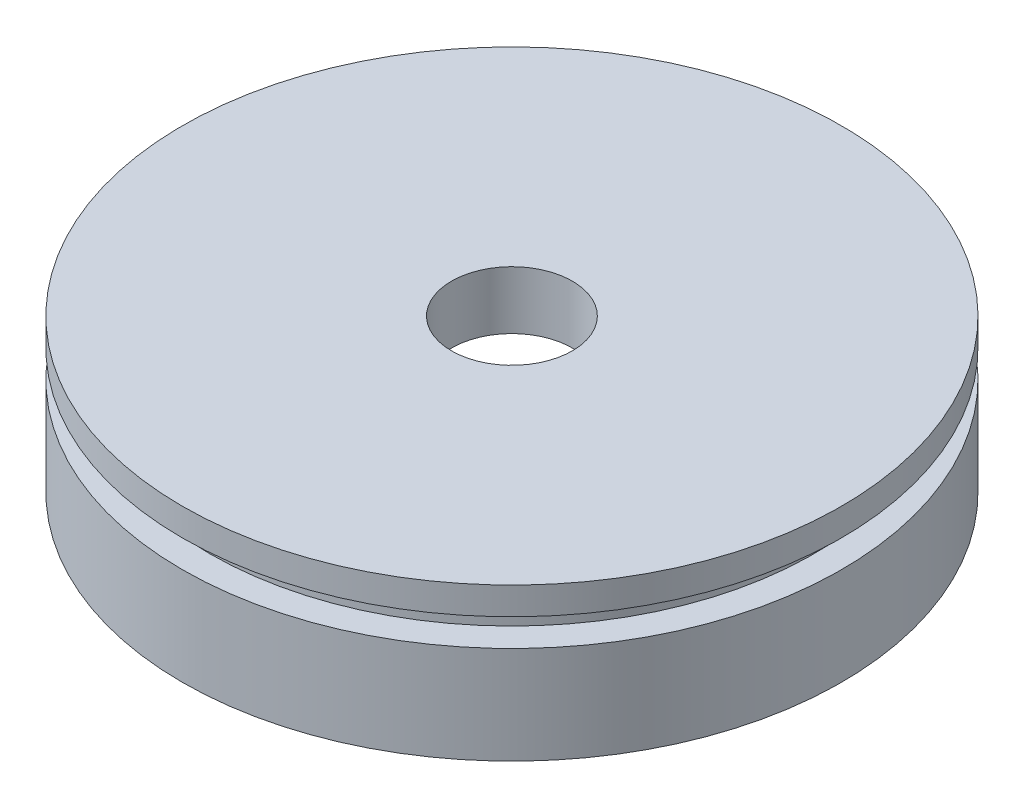
ISO-10303-21;
HEADER;
FILE_DESCRIPTION(('STEP AP214'),'2;1');
FILE_NAME('part.step','',(''),(''),'','','');
FILE_SCHEMA(('AUTOMOTIVE_DESIGN { 1 0 10303 214 1 1 1 1 }'));
ENDSEC;
DATA;
#1=APPLICATION_CONTEXT('core data for automotive mechanical design processes');
#2=APPLICATION_PROTOCOL_DEFINITION('international standard','automotive_design',2000,#1);
#3=PRODUCT_CONTEXT('',#1,'mechanical');
#4=PRODUCT('Part','Part','',(#3));
#5=PRODUCT_RELATED_PRODUCT_CATEGORY('part','',(#4));
#6=PRODUCT_DEFINITION_FORMATION('','',#4);
#7=PRODUCT_DEFINITION_CONTEXT('part definition',#1,'design');
#8=PRODUCT_DEFINITION('design','',#6,#7);
#9=PRODUCT_DEFINITION_SHAPE('','',#8);
#10=(LENGTH_UNIT() NAMED_UNIT(*) SI_UNIT(.MILLI.,.METRE.));
#11=(NAMED_UNIT(*) PLANE_ANGLE_UNIT() SI_UNIT($,.RADIAN.));
#12=(NAMED_UNIT(*) SI_UNIT($,.STERADIAN.) SOLID_ANGLE_UNIT());
#13=UNCERTAINTY_MEASURE_WITH_UNIT(LENGTH_MEASURE(1.E-05),#10,'distance_accuracy_value','');
#14=(GEOMETRIC_REPRESENTATION_CONTEXT(3) GLOBAL_UNCERTAINTY_ASSIGNED_CONTEXT((#13)) GLOBAL_UNIT_ASSIGNED_CONTEXT((#10,
#11,#12)) REPRESENTATION_CONTEXT('',''));
#15=CARTESIAN_POINT('',(0.,0.,0.));
#16=DIRECTION('',(0.,0.,1.));
#17=DIRECTION('',(1.,0.,0.));
#18=AXIS2_PLACEMENT_3D('',#15,#16,#17);
#19=CARTESIAN_POINT('',(0.,50.3580155806544,0.));
#20=DIRECTION('',(0.,1.,0.));
#21=DIRECTION('',(0.,0.,1.));
#22=AXIS2_PLACEMENT_3D('',#19,#20,#21);
#23=CYLINDRICAL_SURFACE('',#22,13.9700000000002);
#24=CARTESIAN_POINT('',(0.,1882.394,0.));
#25=DIRECTION('',(0.,1.,0.));
#26=DIRECTION('',(0.,0.,1.));
#27=AXIS2_PLACEMENT_3D('',#24,#25,#26);
#28=CIRCLE('',#27,13.9700000000002);
#29=CARTESIAN_POINT('',(0.,1882.394,13.9700000000002));
#30=VERTEX_POINT('',#29);
#31=EDGE_CURVE('E74',#30,#30,#28,.T.);
#32=ORIENTED_EDGE('',*,*,#31,.T.);
#33=EDGE_LOOP('',(#32));
#34=FACE_BOUND('',#33,.T.);
#35=CARTESIAN_POINT('',(0.,1868.995022229,0.));
#36=DIRECTION('',(0.,1.,0.));
#37=DIRECTION('',(0.,0.,1.));
#38=AXIS2_PLACEMENT_3D('',#35,#36,#37);
#39=CIRCLE('',#38,13.9700000000002);
#40=CARTESIAN_POINT('',(0.,1868.995022229,13.9700000000002));
#41=VERTEX_POINT('',#40);
#42=EDGE_CURVE('E10',#41,#41,#39,.T.);
#43=ORIENTED_EDGE('',*,*,#42,.F.);
#44=EDGE_LOOP('',(#43));
#45=FACE_BOUND('',#44,.T.);
#46=ADVANCED_FACE('F39',(#34,#45),#23,.F.);
#47=CARTESIAN_POINT('',(-2.08166817117217E-13,1729.74,0.));
#48=DIRECTION('',(0.,1.,0.));
#49=DIRECTION('',(-1.,0.,0.));
#50=AXIS2_PLACEMENT_3D('',#47,#48,#49);
#51=SPHERICAL_SURFACE('',#50,139.954);
#52=ORIENTED_EDGE('',*,*,#42,.T.);
#53=EDGE_LOOP('',(#52));
#54=FACE_BOUND('',#53,.T.);
#55=CARTESIAN_POINT('',(0.,1847.13115007529,0.));
#56=DIRECTION('',(0.,1.,0.));
#57=DIRECTION('',(0.,0.,1.));
#58=AXIS2_PLACEMENT_3D('',#55,#56,#57);
#59=CIRCLE('',#58,76.2000000000002);
#60=CARTESIAN_POINT('',(0.,1847.13115007529,76.2000000000002));
#61=VERTEX_POINT('',#60);
#62=EDGE_CURVE('E46',#61,#61,#59,.T.);
#63=ORIENTED_EDGE('',*,*,#62,.F.);
#64=EDGE_LOOP('',(#63));
#65=FACE_BOUND('',#64,.T.);
#66=ADVANCED_FACE('F93',(#54,#65),#51,.F.);
#67=CARTESIAN_POINT('',(0.,50.3580155806544,0.));
#68=DIRECTION('',(0.,1.,0.));
#69=DIRECTION('',(0.,0.,1.));
#70=AXIS2_PLACEMENT_3D('',#67,#68,#69);
#71=CYLINDRICAL_SURFACE('',#70,76.2000000000002);
#72=ORIENTED_EDGE('',*,*,#62,.T.);
#73=EDGE_LOOP('',(#72));
#74=FACE_BOUND('',#73,.T.);
#75=CARTESIAN_POINT('',(0.,1869.694,0.));
#76=DIRECTION('',(0.,1.,0.));
#77=DIRECTION('',(0.,0.,1.));
#78=AXIS2_PLACEMENT_3D('',#75,#76,#77);
#79=CIRCLE('',#78,76.2000000000002);
#80=CARTESIAN_POINT('',(0.,1869.694,76.2000000000002));
#81=VERTEX_POINT('',#80);
#82=EDGE_CURVE('E51',#81,#81,#79,.T.);
#83=ORIENTED_EDGE('',*,*,#82,.F.);
#84=EDGE_LOOP('',(#83));
#85=FACE_BOUND('',#84,.T.);
#86=ADVANCED_FACE('F97',(#74,#85),#71,.T.);
#87=CARTESIAN_POINT('',(-69.8500000000003,1869.694,0.));
#88=DIRECTION('',(0.,1.,0.));
#89=DIRECTION('',(0.,0.,1.));
#90=AXIS2_PLACEMENT_3D('',#87,#88,#89);
#91=PLANE('',#90);
#92=ORIENTED_EDGE('',*,*,#82,.T.);
#93=EDGE_LOOP('',(#92));
#94=FACE_BOUND('',#93,.T.);
#95=CARTESIAN_POINT('',(0.,1869.694,0.));
#96=DIRECTION('',(0.,1.,0.));
#97=DIRECTION('',(0.,0.,1.));
#98=AXIS2_PLACEMENT_3D('',#95,#96,#97);
#99=CIRCLE('',#98,69.8500000000003);
#100=CARTESIAN_POINT('',(0.,1869.694,69.8500000000003));
#101=VERTEX_POINT('',#100);
#102=EDGE_CURVE('E56',#101,#101,#99,.T.);
#103=ORIENTED_EDGE('',*,*,#102,.F.);
#104=EDGE_LOOP('',(#103));
#105=FACE_BOUND('',#104,.T.);
#106=ADVANCED_FACE('F101',(#94,#105),#91,.T.);
#107=CARTESIAN_POINT('',(0.,50.3580155806544,0.));
#108=DIRECTION('',(0.,1.,0.));
#109=DIRECTION('',(0.,0.,1.));
#110=AXIS2_PLACEMENT_3D('',#107,#108,#109);
#111=CYLINDRICAL_SURFACE('',#110,69.8500000000003);
#112=ORIENTED_EDGE('',*,*,#102,.T.);
#113=EDGE_LOOP('',(#112));
#114=FACE_BOUND('',#113,.T.);
#115=CARTESIAN_POINT('',(0.,1876.044,0.));
#116=DIRECTION('',(0.,1.,0.));
#117=DIRECTION('',(0.,0.,1.));
#118=AXIS2_PLACEMENT_3D('',#115,#116,#117);
#119=CIRCLE('',#118,69.8500000000002);
#120=CARTESIAN_POINT('',(0.,1876.044,69.8500000000002));
#121=VERTEX_POINT('',#120);
#122=EDGE_CURVE('E62',#121,#121,#119,.T.);
#123=ORIENTED_EDGE('',*,*,#122,.F.);
#124=EDGE_LOOP('',(#123));
#125=FACE_BOUND('',#124,.T.);
#126=ADVANCED_FACE('F107',(#114,#125),#111,.T.);
#127=CARTESIAN_POINT('',(-69.8500000000002,1876.044,0.));
#128=DIRECTION('',(0.,-1.,0.));
#129=DIRECTION('',(0.,0.,-1.));
#130=AXIS2_PLACEMENT_3D('',#127,#128,#129);
#131=PLANE('',#130);
#132=ORIENTED_EDGE('',*,*,#122,.T.);
#133=EDGE_LOOP('',(#132));
#134=FACE_BOUND('',#133,.T.);
#135=CARTESIAN_POINT('',(0.,1876.044,0.));
#136=DIRECTION('',(0.,1.,0.));
#137=DIRECTION('',(0.,0.,1.));
#138=AXIS2_PLACEMENT_3D('',#135,#136,#137);
#139=CIRCLE('',#138,76.2000000000002);
#140=CARTESIAN_POINT('',(0.,1876.044,76.2000000000002));
#141=VERTEX_POINT('',#140);
#142=EDGE_CURVE('E66',#141,#141,#139,.T.);
#143=ORIENTED_EDGE('',*,*,#142,.F.);
#144=EDGE_LOOP('',(#143));
#145=FACE_BOUND('',#144,.T.);
#146=ADVANCED_FACE('F89',(#134,#145),#131,.T.);
#147=CARTESIAN_POINT('',(0.,50.3580155806544,0.));
#148=DIRECTION('',(0.,1.,0.));
#149=DIRECTION('',(0.,0.,1.));
#150=AXIS2_PLACEMENT_3D('',#147,#148,#149);
#151=CYLINDRICAL_SURFACE('',#150,76.2000000000002);
#152=ORIENTED_EDGE('',*,*,#142,.T.);
#153=EDGE_LOOP('',(#152));
#154=FACE_BOUND('',#153,.T.);
#155=CARTESIAN_POINT('',(0.,1882.394,0.));
#156=DIRECTION('',(0.,1.,0.));
#157=DIRECTION('',(0.,0.,1.));
#158=AXIS2_PLACEMENT_3D('',#155,#156,#157);
#159=CIRCLE('',#158,76.2000000000002);
#160=CARTESIAN_POINT('',(0.,1882.394,76.2000000000002));
#161=VERTEX_POINT('',#160);
#162=EDGE_CURVE('E70',#161,#161,#159,.T.);
#163=ORIENTED_EDGE('',*,*,#162,.F.);
#164=EDGE_LOOP('',(#163));
#165=FACE_BOUND('',#164,.T.);
#166=ADVANCED_FACE('F83',(#154,#165),#151,.T.);
#167=CARTESIAN_POINT('',(-76.2000000000002,1882.394,0.));
#168=DIRECTION('',(0.,1.,0.));
#169=DIRECTION('',(0.,0.,1.));
#170=AXIS2_PLACEMENT_3D('',#167,#168,#169);
#171=PLANE('',#170);
#172=ORIENTED_EDGE('',*,*,#162,.T.);
#173=EDGE_LOOP('',(#172));
#174=FACE_BOUND('',#173,.T.);
#175=ORIENTED_EDGE('',*,*,#31,.F.);
#176=EDGE_LOOP('',(#175));
#177=FACE_BOUND('',#176,.T.);
#178=ADVANCED_FACE('F81',(#174,#177),#171,.T.);
#179=CLOSED_SHELL('',(#46,#66,#86,#106,#126,#146,#166,#178));
#180=MANIFOLD_SOLID_BREP('B2',#179);
#181=ADVANCED_BREP_SHAPE_REPRESENTATION('',(#18,#180),#14);
#182=SHAPE_DEFINITION_REPRESENTATION(#9,#181);
ENDSEC;
END-ISO-10303-21;
